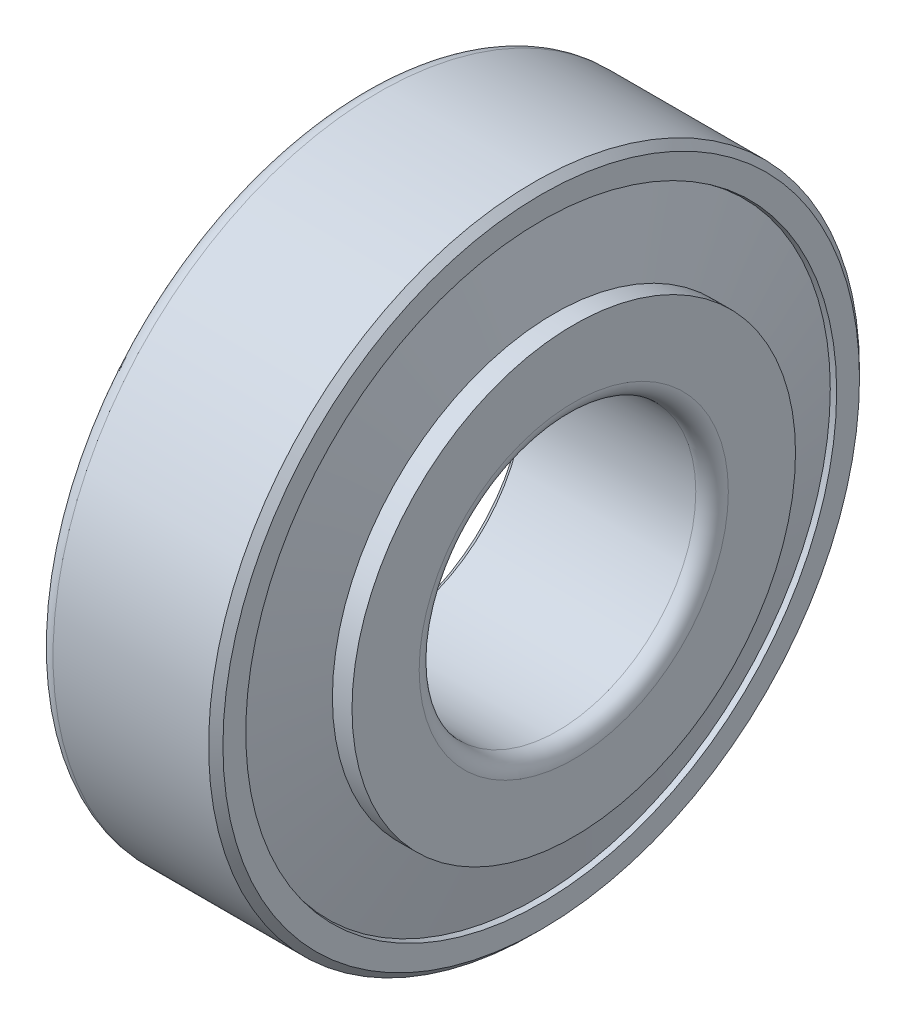
ISO-10303-21;
HEADER;
FILE_DESCRIPTION(('STEP AP214'),'2;1');
FILE_NAME('part.step','',(''),(''),'','','');
FILE_SCHEMA(('AUTOMOTIVE_DESIGN { 1 0 10303 214 1 1 1 1 }'));
ENDSEC;
DATA;
#1=APPLICATION_CONTEXT('core data for automotive mechanical design processes');
#2=APPLICATION_PROTOCOL_DEFINITION('international standard','automotive_design',2000,#1);
#3=PRODUCT_CONTEXT('',#1,'mechanical');
#4=PRODUCT('Part','Part','',(#3));
#5=PRODUCT_RELATED_PRODUCT_CATEGORY('part','',(#4));
#6=PRODUCT_DEFINITION_FORMATION('','',#4);
#7=PRODUCT_DEFINITION_CONTEXT('part definition',#1,'design');
#8=PRODUCT_DEFINITION('design','',#6,#7);
#9=PRODUCT_DEFINITION_SHAPE('','',#8);
#10=(LENGTH_UNIT() NAMED_UNIT(*) SI_UNIT(.MILLI.,.METRE.));
#11=(NAMED_UNIT(*) PLANE_ANGLE_UNIT() SI_UNIT($,.RADIAN.));
#12=(NAMED_UNIT(*) SI_UNIT($,.STERADIAN.) SOLID_ANGLE_UNIT());
#13=UNCERTAINTY_MEASURE_WITH_UNIT(LENGTH_MEASURE(1.E-05),#10,'distance_accuracy_value','');
#14=(GEOMETRIC_REPRESENTATION_CONTEXT(3) GLOBAL_UNCERTAINTY_ASSIGNED_CONTEXT((#13)) GLOBAL_UNIT_ASSIGNED_CONTEXT((#10,
#11,#12)) REPRESENTATION_CONTEXT('',''));
#15=CARTESIAN_POINT('',(0.,0.,0.));
#16=DIRECTION('',(0.,0.,1.));
#17=DIRECTION('',(1.,0.,0.));
#18=AXIS2_PLACEMENT_3D('',#15,#16,#17);
#19=CARTESIAN_POINT('',(-13.,0.,0.));
#20=DIRECTION('',(1.,0.,0.));
#21=DIRECTION('',(0.,0.,-1.));
#22=AXIS2_PLACEMENT_3D('',#19,#20,#21);
#23=CONICAL_SURFACE('',#22,15.704,0.219387886975681);
#24=CARTESIAN_POINT('',(-11.9830842954391,0.,0.));
#25=DIRECTION('',(-1.,0.,0.));
#26=DIRECTION('',(0.,0.,1.));
#27=AXIS2_PLACEMENT_3D('',#24,#25,#26);
#28=CIRCLE('',#27,15.9307485967285);
#29=CARTESIAN_POINT('',(-11.9830842954391,0.,15.9307485967285));
#30=VERTEX_POINT('',#29);
#31=EDGE_CURVE('E43',#30,#30,#28,.T.);
#32=ORIENTED_EDGE('',*,*,#31,.F.);
#33=EDGE_LOOP('',(#32));
#34=FACE_BOUND('',#33,.T.);
#35=CARTESIAN_POINT('',(-13.,0.,0.));
#36=DIRECTION('',(1.,0.,0.));
#37=DIRECTION('',(0.,0.,-1.));
#38=AXIS2_PLACEMENT_3D('',#35,#36,#37);
#39=CIRCLE('',#38,15.704);
#40=CARTESIAN_POINT('',(-13.,0.,-15.704));
#41=VERTEX_POINT('',#40);
#42=EDGE_CURVE('E55',#41,#41,#39,.T.);
#43=ORIENTED_EDGE('',*,*,#42,.F.);
#44=EDGE_LOOP('',(#43));
#45=FACE_BOUND('',#44,.T.);
#46=ADVANCED_FACE('F32',(#34,#45),#23,.F.);
#47=CARTESIAN_POINT('',(-2.,19.56,0.));
#48=DIRECTION('',(1.,0.,0.));
#49=DIRECTION('',(0.,0.,-1.));
#50=AXIS2_PLACEMENT_3D('',#47,#48,#49);
#51=PLANE('',#50);
#52=CARTESIAN_POINT('',(-2.,0.,0.));
#53=DIRECTION('',(1.,0.,0.));
#54=DIRECTION('',(0.,0.,-1.));
#55=AXIS2_PLACEMENT_3D('',#52,#53,#54);
#56=CIRCLE('',#55,19.56);
#57=CARTESIAN_POINT('',(-2.,0.,-19.56));
#58=VERTEX_POINT('',#57);
#59=EDGE_CURVE('E67',#58,#58,#56,.T.);
#60=ORIENTED_EDGE('',*,*,#59,.T.);
#61=EDGE_LOOP('',(#60));
#62=FACE_BOUND('',#61,.T.);
#63=CARTESIAN_POINT('',(-2.,0.,0.));
#64=DIRECTION('',(1.,0.,0.));
#65=DIRECTION('',(0.,0.,-1.));
#66=AXIS2_PLACEMENT_3D('',#63,#64,#65);
#67=CIRCLE('',#66,18.1567446599821);
#68=CARTESIAN_POINT('',(-2.,0.,-18.1567446599821));
#69=VERTEX_POINT('',#68);
#70=EDGE_CURVE('E52',#69,#69,#67,.T.);
#71=ORIENTED_EDGE('',*,*,#70,.F.);
#72=EDGE_LOOP('',(#71));
#73=FACE_BOUND('',#72,.T.);
#74=ADVANCED_FACE('F34',(#62,#73),#51,.T.);
#75=CARTESIAN_POINT('',(-2.32037890329752,0.,0.));
#76=DIRECTION('',(-1.,0.,0.));
#77=DIRECTION('',(0.,0.,1.));
#78=AXIS2_PLACEMENT_3D('',#75,#76,#77);
#79=CIRCLE('',#78,18.0853076014154);
#80=CARTESIAN_POINT('',(-2.32037890329752,0.,18.0853076014154));
#81=VERTEX_POINT('',#80);
#82=EDGE_CURVE('E47',#81,#81,#79,.F.);
#83=ORIENTED_EDGE('',*,*,#82,.F.);
#84=EDGE_LOOP('',(#83));
#85=FACE_BOUND('',#84,.T.);
#86=ORIENTED_EDGE('',*,*,#70,.T.);
#87=EDGE_LOOP('',(#86));
#88=FACE_BOUND('',#87,.T.);
#89=ADVANCED_FACE('F120',(#85,#88),#23,.F.);
#90=CARTESIAN_POINT('',(-13.,15.704,0.));
#91=DIRECTION('',(-1.,0.,0.));
#92=DIRECTION('',(0.,0.,1.));
#93=AXIS2_PLACEMENT_3D('',#90,#91,#92);
#94=PLANE('',#93);
#95=ORIENTED_EDGE('',*,*,#42,.T.);
#96=EDGE_LOOP('',(#95));
#97=FACE_BOUND('',#96,.T.);
#98=CARTESIAN_POINT('',(-13.,0.,0.));
#99=DIRECTION('',(1.,0.,0.));
#100=DIRECTION('',(0.,0.,-1.));
#101=AXIS2_PLACEMENT_3D('',#98,#99,#100);
#102=CIRCLE('',#101,19.);
#103=CARTESIAN_POINT('',(-13.,0.,-19.));
#104=VERTEX_POINT('',#103);
#105=EDGE_CURVE('E58',#104,#104,#102,.T.);
#106=ORIENTED_EDGE('',*,*,#105,.F.);
#107=EDGE_LOOP('',(#106));
#108=FACE_BOUND('',#107,.T.);
#109=ADVANCED_FACE('F129',(#97,#108),#94,.T.);
#110=CARTESIAN_POINT('',(-12.,0.,0.));
#111=DIRECTION('',(1.,0.,0.));
#112=DIRECTION('',(0.,0.,-1.));
#113=AXIS2_PLACEMENT_3D('',#110,#111,#112);
#114=TOROIDAL_SURFACE('',#113,19.,0.999999999999999);
#115=ORIENTED_EDGE('',*,*,#105,.T.);
#116=EDGE_LOOP('',(#115));
#117=FACE_BOUND('',#116,.T.);
#118=CARTESIAN_POINT('',(-12.,0.,0.));
#119=DIRECTION('',(1.,0.,0.));
#120=DIRECTION('',(0.,0.,-1.));
#121=AXIS2_PLACEMENT_3D('',#118,#119,#120);
#122=CIRCLE('',#121,20.);
#123=CARTESIAN_POINT('',(-12.,0.,-20.));
#124=VERTEX_POINT('',#123);
#125=EDGE_CURVE('E61',#124,#124,#122,.T.);
#126=ORIENTED_EDGE('',*,*,#125,.F.);
#127=EDGE_LOOP('',(#126));
#128=FACE_BOUND('',#127,.T.);
#129=ADVANCED_FACE('F134',(#117,#128),#114,.T.);
#130=CARTESIAN_POINT('',(-42.5,0.,0.));
#131=DIRECTION('',(1.,0.,0.));
#132=DIRECTION('',(0.,0.,-1.));
#133=AXIS2_PLACEMENT_3D('',#130,#131,#132);
#134=CYLINDRICAL_SURFACE('',#133,20.);
#135=ORIENTED_EDGE('',*,*,#125,.T.);
#136=EDGE_LOOP('',(#135));
#137=FACE_BOUND('',#136,.T.);
#138=CARTESIAN_POINT('',(-2.44,0.,0.));
#139=DIRECTION('',(1.,0.,0.));
#140=DIRECTION('',(0.,0.,-1.));
#141=AXIS2_PLACEMENT_3D('',#138,#139,#140);
#142=CIRCLE('',#141,20.);
#143=CARTESIAN_POINT('',(-2.44,0.,-20.));
#144=VERTEX_POINT('',#143);
#145=EDGE_CURVE('E64',#144,#144,#142,.T.);
#146=ORIENTED_EDGE('',*,*,#145,.F.);
#147=EDGE_LOOP('',(#146));
#148=FACE_BOUND('',#147,.T.);
#149=ADVANCED_FACE('F156',(#137,#148),#134,.T.);
#150=CARTESIAN_POINT('',(-2.,0.,0.));
#151=DIRECTION('',(-1.,0.,0.));
#152=DIRECTION('',(0.,0.,1.));
#153=AXIS2_PLACEMENT_3D('',#150,#151,#152);
#154=CONICAL_SURFACE('',#153,19.56,0.785398163397445);
#155=ORIENTED_EDGE('',*,*,#145,.T.);
#156=EDGE_LOOP('',(#155));
#157=FACE_BOUND('',#156,.T.);
#158=ORIENTED_EDGE('',*,*,#59,.F.);
#159=EDGE_LOOP('',(#158));
#160=FACE_BOUND('',#159,.T.);
#161=ADVANCED_FACE('F150',(#157,#160),#154,.T.);
#162=CARTESIAN_POINT('',(-12.,0.,0.));
#163=DIRECTION('',(-1.,0.,0.));
#164=DIRECTION('',(0.,0.,1.));
#165=AXIS2_PLACEMENT_3D('',#162,#163,#164);
#166=CONICAL_SURFACE('',#165,16.006611670943,1.35140843981922);
#167=CARTESIAN_POINT('',(-10.9314484911935,0.,0.));
#168=DIRECTION('',(-1.,0.,0.));
#169=DIRECTION('',(0.,0.,1.));
#170=AXIS2_PLACEMENT_3D('',#167,#168,#169);
#171=CIRCLE('',#170,11.2144020338594);
#172=CARTESIAN_POINT('',(-10.9314484911935,0.,11.2144020338594));
#173=VERTEX_POINT('',#172);
#174=EDGE_CURVE('E10',#173,#173,#171,.T.);
#175=ORIENTED_EDGE('',*,*,#174,.F.);
#176=EDGE_LOOP('',(#175));
#177=FACE_BOUND('',#176,.T.);
#178=ORIENTED_EDGE('',*,*,#31,.T.);
#179=EDGE_LOOP('',(#178));
#180=FACE_BOUND('',#179,.T.);
#181=ADVANCED_FACE('F144',(#177,#180),#166,.F.);
#182=CARTESIAN_POINT('',(-10.87375324755,0.,0.));
#183=DIRECTION('',(1.,0.,0.));
#184=DIRECTION('',(0.,0.,-1.));
#185=AXIS2_PLACEMENT_3D('',#182,#183,#184);
#186=CONICAL_SURFACE('',#185,10.9556520341417,0.219387886975681);
#187=CARTESIAN_POINT('',(-10.8683887316016,0.,0.));
#188=DIRECTION('',(-1.,0.,0.));
#189=DIRECTION('',(0.,0.,1.));
#190=AXIS2_PLACEMENT_3D('',#187,#188,#189);
#191=CIRCLE('',#190,10.9568481966732);
#192=CARTESIAN_POINT('',(-10.8683887316016,0.,10.9568481966732));
#193=VERTEX_POINT('',#192);
#194=EDGE_CURVE('E39',#193,#193,#191,.F.);
#195=ORIENTED_EDGE('',*,*,#194,.F.);
#196=EDGE_LOOP('',(#195));
#197=FACE_BOUND('',#196,.T.);
#198=CARTESIAN_POINT('',(-1.21104785540843,0.,0.));
#199=DIRECTION('',(1.,0.,0.));
#200=DIRECTION('',(0.,0.,-1.));
#201=AXIS2_PLACEMENT_3D('',#198,#199,#200);
#202=CIRCLE('',#201,13.1102110388286);
#203=CARTESIAN_POINT('',(-1.21104785540843,0.,-13.1102110388286));
#204=VERTEX_POINT('',#203);
#205=EDGE_CURVE('E70',#204,#204,#202,.T.);
#206=ORIENTED_EDGE('',*,*,#205,.T.);
#207=EDGE_LOOP('',(#206));
#208=FACE_BOUND('',#207,.T.);
#209=ADVANCED_FACE('F115',(#197,#208),#186,.F.);
#210=CARTESIAN_POINT('',(-1.21104785540843,0.,0.));
#211=DIRECTION('',(-1.,0.,0.));
#212=DIRECTION('',(0.,0.,1.));
#213=AXIS2_PLACEMENT_3D('',#210,#211,#212);
#214=CONICAL_SURFACE('',#213,13.1102110388286,1.35140843981922);
#215=ORIENTED_EDGE('',*,*,#82,.T.);
#216=EDGE_LOOP('',(#215));
#217=FACE_BOUND('',#216,.T.);
#218=ORIENTED_EDGE('',*,*,#205,.F.);
#219=EDGE_LOOP('',(#218));
#220=FACE_BOUND('',#219,.T.);
#221=ADVANCED_FACE('F107',(#217,#220),#214,.T.);
#222=CARTESIAN_POINT('',(-10.8681220150603,0.,0.));
#223=DIRECTION('',(-1.,0.,0.));
#224=DIRECTION('',(0.,0.,1.));
#225=AXIS2_PLACEMENT_3D('',#222,#223,#224);
#226=CONICAL_SURFACE('',#225,10.9556520338594,1.35140843981921);
#227=ORIENTED_EDGE('',*,*,#194,.T.);
#228=EDGE_LOOP('',(#227));
#229=FACE_BOUND('',#228,.T.);
#230=CARTESIAN_POINT('',(-10.8681220150603,0.,0.));
#231=DIRECTION('',(1.,0.,0.));
#232=DIRECTION('',(0.,0.,-1.));
#233=AXIS2_PLACEMENT_3D('',#230,#231,#232);
#234=CIRCLE('',#233,10.9556520338594);
#235=CARTESIAN_POINT('',(-10.8681220150603,0.,-10.9556520338594));
#236=VERTEX_POINT('',#235);
#237=EDGE_CURVE('E97',#236,#236,#234,.T.);
#238=ORIENTED_EDGE('',*,*,#237,.F.);
#239=EDGE_LOOP('',(#238));
#240=FACE_BOUND('',#239,.T.);
#241=ADVANCED_FACE('F104',(#229,#240),#226,.T.);
#242=CARTESIAN_POINT('',(-42.5,0.,0.));
#243=DIRECTION('',(1.,0.,0.));
#244=DIRECTION('',(0.,0.,-1.));
#245=AXIS2_PLACEMENT_3D('',#242,#243,#244);
#246=CYLINDRICAL_SURFACE('',#245,11.2144020338594);
#247=ORIENTED_EDGE('',*,*,#174,.T.);
#248=EDGE_LOOP('',(#247));
#249=FACE_BOUND('',#248,.T.);
#250=CARTESIAN_POINT('',(-12.,0.,0.));
#251=DIRECTION('',(1.,0.,0.));
#252=DIRECTION('',(0.,0.,-1.));
#253=AXIS2_PLACEMENT_3D('',#250,#251,#252);
#254=CIRCLE('',#253,11.2144020338594);
#255=CARTESIAN_POINT('',(-12.,0.,-11.2144020338594));
#256=VERTEX_POINT('',#255);
#257=EDGE_CURVE('E73',#256,#256,#254,.T.);
#258=ORIENTED_EDGE('',*,*,#257,.T.);
#259=EDGE_LOOP('',(#258));
#260=FACE_BOUND('',#259,.T.);
#261=ADVANCED_FACE('F106',(#249,#260),#246,.T.);
#262=CARTESIAN_POINT('',(-12.,11.2144020338594,0.));
#263=DIRECTION('',(-1.,0.,0.));
#264=DIRECTION('',(0.,0.,1.));
#265=AXIS2_PLACEMENT_3D('',#262,#263,#264);
#266=PLANE('',#265);
#267=CARTESIAN_POINT('',(-12.,0.,0.));
#268=DIRECTION('',(1.,0.,0.));
#269=DIRECTION('',(0.,0.,-1.));
#270=AXIS2_PLACEMENT_3D('',#267,#268,#269);
#271=CIRCLE('',#270,8.94);
#272=CARTESIAN_POINT('',(-12.,0.,-8.94));
#273=VERTEX_POINT('',#272);
#274=EDGE_CURVE('E76',#273,#273,#271,.T.);
#275=ORIENTED_EDGE('',*,*,#274,.T.);
#276=EDGE_LOOP('',(#275));
#277=FACE_BOUND('',#276,.T.);
#278=ORIENTED_EDGE('',*,*,#257,.F.);
#279=EDGE_LOOP('',(#278));
#280=FACE_BOUND('',#279,.T.);
#281=ADVANCED_FACE('F113',(#277,#280),#266,.T.);
#282=CARTESIAN_POINT('',(-12.,0.,0.));
#283=DIRECTION('',(-1.,0.,0.));
#284=DIRECTION('',(0.,0.,1.));
#285=AXIS2_PLACEMENT_3D('',#282,#283,#284);
#286=CONICAL_SURFACE('',#285,8.94,0.785398163397446);
#287=CARTESIAN_POINT('',(-11.56,0.,0.));
#288=DIRECTION('',(1.,0.,0.));
#289=DIRECTION('',(0.,0.,-1.));
#290=AXIS2_PLACEMENT_3D('',#287,#288,#289);
#291=CIRCLE('',#290,8.5);
#292=CARTESIAN_POINT('',(-11.56,0.,-8.5));
#293=VERTEX_POINT('',#292);
#294=EDGE_CURVE('E79',#293,#293,#291,.T.);
#295=ORIENTED_EDGE('',*,*,#294,.T.);
#296=EDGE_LOOP('',(#295));
#297=FACE_BOUND('',#296,.T.);
#298=ORIENTED_EDGE('',*,*,#274,.F.);
#299=EDGE_LOOP('',(#298));
#300=FACE_BOUND('',#299,.T.);
#301=ADVANCED_FACE('F214',(#297,#300),#286,.F.);
#302=CARTESIAN_POINT('',(-42.5,0.,0.));
#303=DIRECTION('',(1.,0.,0.));
#304=DIRECTION('',(0.,0.,-1.));
#305=AXIS2_PLACEMENT_3D('',#302,#303,#304);
#306=CYLINDRICAL_SURFACE('',#305,8.5);
#307=CARTESIAN_POINT('',(-1.,0.,0.));
#308=DIRECTION('',(1.,0.,0.));
#309=DIRECTION('',(0.,0.,-1.));
#310=AXIS2_PLACEMENT_3D('',#307,#308,#309);
#311=CIRCLE('',#310,8.5);
#312=CARTESIAN_POINT('',(-1.,0.,-8.5));
#313=VERTEX_POINT('',#312);
#314=EDGE_CURVE('E82',#313,#313,#311,.T.);
#315=ORIENTED_EDGE('',*,*,#314,.T.);
#316=EDGE_LOOP('',(#315));
#317=FACE_BOUND('',#316,.T.);
#318=ORIENTED_EDGE('',*,*,#294,.F.);
#319=EDGE_LOOP('',(#318));
#320=FACE_BOUND('',#319,.T.);
#321=ADVANCED_FACE('F224',(#317,#320),#306,.F.);
#322=CARTESIAN_POINT('',(-1.,0.,0.));
#323=DIRECTION('',(1.,0.,0.));
#324=DIRECTION('',(0.,0.,-1.));
#325=AXIS2_PLACEMENT_3D('',#322,#323,#324);
#326=TOROIDAL_SURFACE('',#325,9.5,1.);
#327=CARTESIAN_POINT('',(0.,0.,0.));
#328=DIRECTION('',(1.,0.,0.));
#329=DIRECTION('',(0.,0.,-1.));
#330=AXIS2_PLACEMENT_3D('',#327,#328,#329);
#331=CIRCLE('',#330,9.5);
#332=CARTESIAN_POINT('',(0.,0.,-9.5));
#333=VERTEX_POINT('',#332);
#334=EDGE_CURVE('E85',#333,#333,#331,.T.);
#335=ORIENTED_EDGE('',*,*,#334,.T.);
#336=EDGE_LOOP('',(#335));
#337=FACE_BOUND('',#336,.T.);
#338=ORIENTED_EDGE('',*,*,#314,.F.);
#339=EDGE_LOOP('',(#338));
#340=FACE_BOUND('',#339,.T.);
#341=ADVANCED_FACE('F234',(#337,#340),#326,.T.);
#342=CARTESIAN_POINT('',(0.,9.5,0.));
#343=DIRECTION('',(1.,0.,0.));
#344=DIRECTION('',(0.,0.,-1.));
#345=AXIS2_PLACEMENT_3D('',#342,#343,#344);
#346=PLANE('',#345);
#347=CARTESIAN_POINT('',(0.,0.,0.));
#348=DIRECTION('',(1.,0.,0.));
#349=DIRECTION('',(0.,0.,-1.));
#350=AXIS2_PLACEMENT_3D('',#347,#348,#349);
#351=CIRCLE('',#350,13.6277110385463);
#352=CARTESIAN_POINT('',(0.,0.,-13.6277110385463));
#353=VERTEX_POINT('',#352);
#354=EDGE_CURVE('E88',#353,#353,#351,.T.);
#355=ORIENTED_EDGE('',*,*,#354,.T.);
#356=EDGE_LOOP('',(#355));
#357=FACE_BOUND('',#356,.T.);
#358=ORIENTED_EDGE('',*,*,#334,.F.);
#359=EDGE_LOOP('',(#358));
#360=FACE_BOUND('',#359,.T.);
#361=ADVANCED_FACE('F244',(#357,#360),#346,.T.);
#362=CARTESIAN_POINT('',(-42.5,0.,0.));
#363=DIRECTION('',(1.,0.,0.));
#364=DIRECTION('',(0.,0.,-1.));
#365=AXIS2_PLACEMENT_3D('',#362,#363,#364);
#366=CYLINDRICAL_SURFACE('',#365,13.6277110385463);
#367=CARTESIAN_POINT('',(-1.20541662291868,0.,0.));
#368=DIRECTION('',(1.,0.,0.));
#369=DIRECTION('',(0.,0.,-1.));
#370=AXIS2_PLACEMENT_3D('',#367,#368,#369);
#371=CIRCLE('',#370,13.6277110385463);
#372=CARTESIAN_POINT('',(-1.20541662291868,0.,-13.6277110385463));
#373=VERTEX_POINT('',#372);
#374=EDGE_CURVE('E91',#373,#373,#371,.T.);
#375=ORIENTED_EDGE('',*,*,#374,.T.);
#376=EDGE_LOOP('',(#375));
#377=FACE_BOUND('',#376,.T.);
#378=ORIENTED_EDGE('',*,*,#354,.F.);
#379=EDGE_LOOP('',(#378));
#380=FACE_BOUND('',#379,.T.);
#381=ADVANCED_FACE('F254',(#377,#380),#366,.T.);
#382=CARTESIAN_POINT('',(-1.20541662291868,13.6277110385463,0.));
#383=DIRECTION('',(-1.,0.,0.));
#384=DIRECTION('',(0.,0.,1.));
#385=AXIS2_PLACEMENT_3D('',#382,#383,#384);
#386=PLANE('',#385);
#387=CARTESIAN_POINT('',(-1.20541662291868,0.,0.));
#388=DIRECTION('',(1.,0.,0.));
#389=DIRECTION('',(0.,0.,-1.));
#390=AXIS2_PLACEMENT_3D('',#387,#388,#389);
#391=CIRCLE('',#390,13.1102110385462);
#392=CARTESIAN_POINT('',(-1.20541662291868,0.,-13.1102110385462));
#393=VERTEX_POINT('',#392);
#394=EDGE_CURVE('E94',#393,#393,#391,.T.);
#395=ORIENTED_EDGE('',*,*,#394,.T.);
#396=EDGE_LOOP('',(#395));
#397=FACE_BOUND('',#396,.T.);
#398=ORIENTED_EDGE('',*,*,#374,.F.);
#399=EDGE_LOOP('',(#398));
#400=FACE_BOUND('',#399,.T.);
#401=ADVANCED_FACE('F264',(#397,#400),#386,.T.);
#402=CARTESIAN_POINT('',(-1.20541662291868,0.,0.));
#403=DIRECTION('',(1.,0.,0.));
#404=DIRECTION('',(0.,0.,-1.));
#405=AXIS2_PLACEMENT_3D('',#402,#403,#404);
#406=CONICAL_SURFACE('',#405,13.1102110385462,0.219387886975681);
#407=ORIENTED_EDGE('',*,*,#237,.T.);
#408=EDGE_LOOP('',(#407));
#409=FACE_BOUND('',#408,.T.);
#410=ORIENTED_EDGE('',*,*,#394,.F.);
#411=EDGE_LOOP('',(#410));
#412=FACE_BOUND('',#411,.T.);
#413=ADVANCED_FACE('F101',(#409,#412),#406,.T.);
#414=CLOSED_SHELL('',(#46,#74,#89,#109,#129,#149,#161,#181,#209,#221,#241,#261,#281,#301,#321,
#341,#361,#381,#401,#413));
#415=MANIFOLD_SOLID_BREP('B2',#414);
#416=ADVANCED_BREP_SHAPE_REPRESENTATION('',(#18,#415),#14);
#417=SHAPE_DEFINITION_REPRESENTATION(#9,#416);
ENDSEC;
END-ISO-10303-21;
